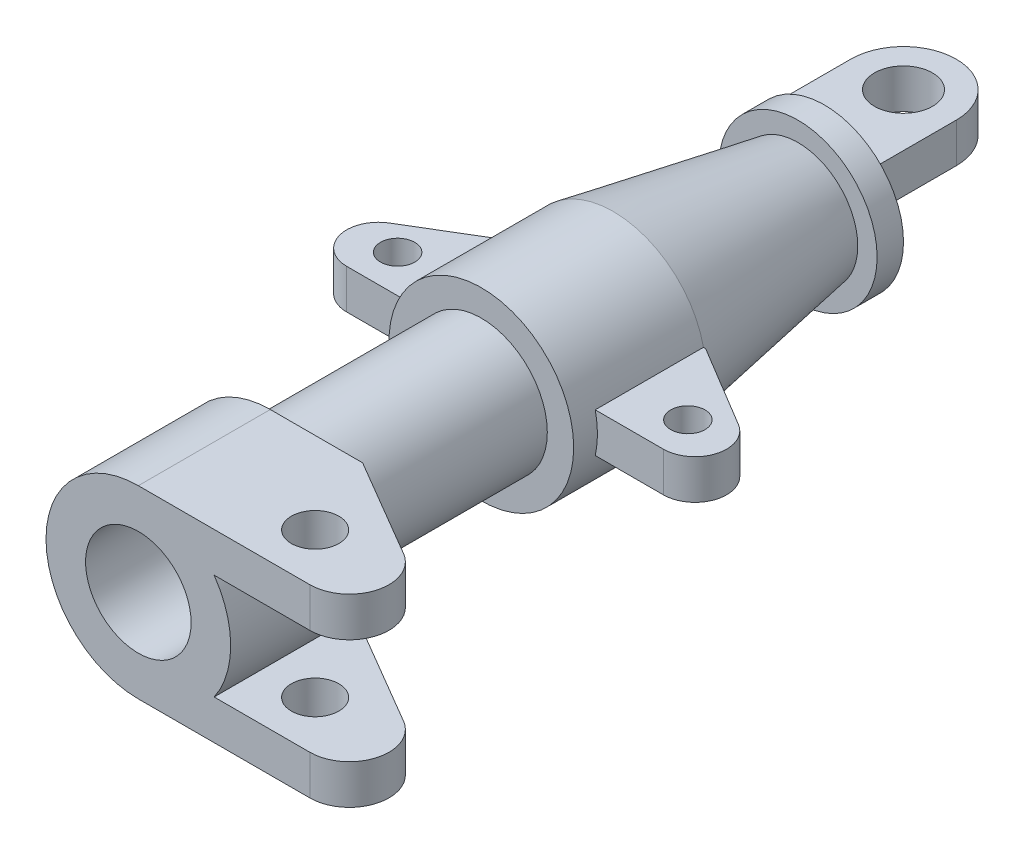
ISO-10303-21;
HEADER;
FILE_DESCRIPTION(('STEP AP214'),'2;1');
FILE_NAME('part.step','',(''),(''),'','','');
FILE_SCHEMA(('AUTOMOTIVE_DESIGN { 1 0 10303 214 1 1 1 1 }'));
ENDSEC;
DATA;
#1=APPLICATION_CONTEXT('core data for automotive mechanical design processes');
#2=APPLICATION_PROTOCOL_DEFINITION('international standard','automotive_design',2000,#1);
#3=PRODUCT_CONTEXT('',#1,'mechanical');
#4=PRODUCT('Part','Part','',(#3));
#5=PRODUCT_RELATED_PRODUCT_CATEGORY('part','',(#4));
#6=PRODUCT_DEFINITION_FORMATION('','',#4);
#7=PRODUCT_DEFINITION_CONTEXT('part definition',#1,'design');
#8=PRODUCT_DEFINITION('design','',#6,#7);
#9=PRODUCT_DEFINITION_SHAPE('','',#8);
#10=(LENGTH_UNIT() NAMED_UNIT(*) SI_UNIT(.MILLI.,.METRE.));
#11=(NAMED_UNIT(*) PLANE_ANGLE_UNIT() SI_UNIT($,.RADIAN.));
#12=(NAMED_UNIT(*) SI_UNIT($,.STERADIAN.) SOLID_ANGLE_UNIT());
#13=UNCERTAINTY_MEASURE_WITH_UNIT(LENGTH_MEASURE(1.E-05),#10,'distance_accuracy_value','');
#14=(GEOMETRIC_REPRESENTATION_CONTEXT(3) GLOBAL_UNCERTAINTY_ASSIGNED_CONTEXT((#13)) GLOBAL_UNIT_ASSIGNED_CONTEXT((#10,
#11,#12)) REPRESENTATION_CONTEXT('',''));
#15=CARTESIAN_POINT('',(0.,0.,0.));
#16=DIRECTION('',(0.,0.,1.));
#17=DIRECTION('',(1.,0.,0.));
#18=AXIS2_PLACEMENT_3D('',#15,#16,#17);
#19=CARTESIAN_POINT('',(0.,0.,-50.));
#20=DIRECTION('',(0.,0.,-1.));
#21=DIRECTION('',(-1.,0.,0.));
#22=AXIS2_PLACEMENT_3D('',#19,#20,#21);
#23=PLANE('',#22);
#24=CARTESIAN_POINT('',(0.,0.,-50.));
#25=DIRECTION('',(0.,0.,1.));
#26=DIRECTION('',(1.,0.,0.));
#27=AXIS2_PLACEMENT_3D('',#24,#25,#26);
#28=CIRCLE('',#27,25.);
#29=CARTESIAN_POINT('',(25.,0.,-50.));
#30=VERTEX_POINT('',#29);
#31=EDGE_CURVE('E398',#30,#30,#28,.T.);
#32=ORIENTED_EDGE('',*,*,#31,.T.);
#33=EDGE_LOOP('',(#32));
#34=FACE_BOUND('',#33,.T.);
#35=DIRECTION('',(0.,-1.,0.));
#36=VECTOR('',#35,1.);
#37=CARTESIAN_POINT('',(35.,35.,-50.));
#38=LINE('',#37,#36);
#39=CARTESIAN_POINT('',(35.,35.,-50.));
#40=VERTEX_POINT('',#39);
#41=CARTESIAN_POINT('',(35.,20.,-50.));
#42=VERTEX_POINT('',#41);
#43=EDGE_CURVE('E305',#40,#42,#38,.T.);
#44=ORIENTED_EDGE('',*,*,#43,.T.);
#45=DIRECTION('',(-1.,0.,0.));
#46=VECTOR('',#45,1.);
#47=CARTESIAN_POINT('',(0.,20.,-50.));
#48=LINE('',#47,#46);
#49=CARTESIAN_POINT('',(28.7228132326902,20.,-50.));
#50=VERTEX_POINT('',#49);
#51=EDGE_CURVE('E237',#42,#50,#48,.T.);
#52=ORIENTED_EDGE('',*,*,#51,.T.);
#53=CARTESIAN_POINT('',(0.,0.,-50.));
#54=DIRECTION('',(0.,0.,-1.));
#55=DIRECTION('',(-1.,0.,0.));
#56=AXIS2_PLACEMENT_3D('',#53,#54,#55);
#57=CIRCLE('',#56,35.);
#58=CARTESIAN_POINT('',(28.7228132326902,-20.,-50.));
#59=VERTEX_POINT('',#58);
#60=EDGE_CURVE('E250',#50,#59,#57,.T.);
#61=ORIENTED_EDGE('',*,*,#60,.T.);
#62=DIRECTION('',(-1.,0.,0.));
#63=VECTOR('',#62,1.);
#64=CARTESIAN_POINT('',(0.,-20.,-50.));
#65=LINE('',#64,#63);
#66=CARTESIAN_POINT('',(35.,-20.,-50.));
#67=VERTEX_POINT('',#66);
#68=EDGE_CURVE('E241',#67,#59,#65,.T.);
#69=ORIENTED_EDGE('',*,*,#68,.F.);
#70=CARTESIAN_POINT('',(35.,-35.,-50.));
#71=VERTEX_POINT('',#70);
#72=EDGE_CURVE('E304',#67,#71,#38,.T.);
#73=ORIENTED_EDGE('',*,*,#72,.T.);
#74=DIRECTION('',(-1.,0.,0.));
#75=VECTOR('',#74,1.);
#76=CARTESIAN_POINT('',(0.,-35.,-50.));
#77=LINE('',#76,#75);
#78=CARTESIAN_POINT('',(0.,-35.,-50.));
#79=VERTEX_POINT('',#78);
#80=EDGE_CURVE('E70',#71,#79,#77,.T.);
#81=ORIENTED_EDGE('',*,*,#80,.T.);
#82=CARTESIAN_POINT('',(0.,0.,-50.));
#83=DIRECTION('',(0.,0.,1.));
#84=DIRECTION('',(1.,0.,0.));
#85=AXIS2_PLACEMENT_3D('',#82,#83,#84);
#86=CIRCLE('',#85,35.);
#87=CARTESIAN_POINT('',(0.,35.,-50.));
#88=VERTEX_POINT('',#87);
#89=EDGE_CURVE('E396',#88,#79,#86,.T.);
#90=ORIENTED_EDGE('',*,*,#89,.F.);
#91=DIRECTION('',(-1.,0.,0.));
#92=VECTOR('',#91,1.);
#93=CARTESIAN_POINT('',(0.,35.,-50.));
#94=LINE('',#93,#92);
#95=EDGE_CURVE('E302',#40,#88,#94,.T.);
#96=ORIENTED_EDGE('',*,*,#95,.F.);
#97=EDGE_LOOP('',(#44,#52,#61,#69,#73,#81,#90,#96));
#98=FACE_BOUND('',#97,.T.);
#99=ADVANCED_FACE('F45',(#34,#98),#23,.T.);
#100=CARTESIAN_POINT('',(0.,0.,0.));
#101=DIRECTION('',(0.,0.,1.));
#102=DIRECTION('',(1.,0.,0.));
#103=AXIS2_PLACEMENT_3D('',#100,#101,#102);
#104=PLANE('',#103);
#105=CARTESIAN_POINT('',(0.,0.,0.));
#106=DIRECTION('',(0.,0.,1.));
#107=DIRECTION('',(1.,0.,0.));
#108=AXIS2_PLACEMENT_3D('',#105,#106,#107);
#109=CIRCLE('',#108,20.);
#110=CARTESIAN_POINT('',(20.,0.,0.));
#111=VERTEX_POINT('',#110);
#112=EDGE_CURVE('E390',#111,#111,#109,.T.);
#113=ORIENTED_EDGE('',*,*,#112,.F.);
#114=EDGE_LOOP('',(#113));
#115=FACE_BOUND('',#114,.T.);
#116=CARTESIAN_POINT('',(0.,0.,0.));
#117=DIRECTION('',(0.,0.,-1.));
#118=DIRECTION('',(-1.,0.,0.));
#119=AXIS2_PLACEMENT_3D('',#116,#117,#118);
#120=CIRCLE('',#119,35.);
#121=CARTESIAN_POINT('',(28.7228132326902,20.,0.));
#122=VERTEX_POINT('',#121);
#123=CARTESIAN_POINT('',(28.7228132326902,-20.,0.));
#124=VERTEX_POINT('',#123);
#125=EDGE_CURVE('E253',#122,#124,#120,.T.);
#126=ORIENTED_EDGE('',*,*,#125,.F.);
#127=DIRECTION('',(-1.,0.,0.));
#128=VECTOR('',#127,1.);
#129=CARTESIAN_POINT('',(0.,20.,0.));
#130=LINE('',#129,#128);
#131=CARTESIAN_POINT('',(65.,20.,0.));
#132=VERTEX_POINT('',#131);
#133=EDGE_CURVE('E247',#132,#122,#130,.T.);
#134=ORIENTED_EDGE('',*,*,#133,.F.);
#135=DIRECTION('',(0.,-1.,0.));
#136=VECTOR('',#135,1.);
#137=CARTESIAN_POINT('',(65.,35.,0.));
#138=LINE('',#137,#136);
#139=CARTESIAN_POINT('',(65.,35.,0.));
#140=VERTEX_POINT('',#139);
#141=EDGE_CURVE('E313',#140,#132,#138,.T.);
#142=ORIENTED_EDGE('',*,*,#141,.F.);
#143=DIRECTION('',(1.,0.,0.));
#144=VECTOR('',#143,1.);
#145=CARTESIAN_POINT('',(0.,35.,0.));
#146=LINE('',#145,#144);
#147=CARTESIAN_POINT('',(0.,35.,0.));
#148=VERTEX_POINT('',#147);
#149=EDGE_CURVE('E294',#148,#140,#146,.T.);
#150=ORIENTED_EDGE('',*,*,#149,.F.);
#151=CARTESIAN_POINT('',(0.,0.,0.));
#152=DIRECTION('',(0.,0.,1.));
#153=DIRECTION('',(1.,0.,0.));
#154=AXIS2_PLACEMENT_3D('',#151,#152,#153);
#155=CIRCLE('',#154,35.);
#156=CARTESIAN_POINT('',(0.,-35.,0.));
#157=VERTEX_POINT('',#156);
#158=EDGE_CURVE('E393',#148,#157,#155,.T.);
#159=ORIENTED_EDGE('',*,*,#158,.T.);
#160=DIRECTION('',(1.,0.,0.));
#161=VECTOR('',#160,1.);
#162=CARTESIAN_POINT('',(0.,-35.,0.));
#163=LINE('',#162,#161);
#164=CARTESIAN_POINT('',(65.,-35.,0.));
#165=VERTEX_POINT('',#164);
#166=EDGE_CURVE('E281',#157,#165,#163,.T.);
#167=ORIENTED_EDGE('',*,*,#166,.T.);
#168=CARTESIAN_POINT('',(65.,-20.,0.));
#169=VERTEX_POINT('',#168);
#170=EDGE_CURVE('E312',#169,#165,#138,.T.);
#171=ORIENTED_EDGE('',*,*,#170,.F.);
#172=DIRECTION('',(-1.,0.,0.));
#173=VECTOR('',#172,1.);
#174=CARTESIAN_POINT('',(0.,-20.,0.));
#175=LINE('',#174,#173);
#176=EDGE_CURVE('E249',#169,#124,#175,.T.);
#177=ORIENTED_EDGE('',*,*,#176,.T.);
#178=EDGE_LOOP('',(#126,#134,#142,#150,#159,#167,#171,#177));
#179=FACE_BOUND('',#178,.T.);
#180=ADVANCED_FACE('F461',(#115,#179),#104,.T.);
#181=CARTESIAN_POINT('',(65.,35.,-15.));
#182=DIRECTION('',(0.,-1.,0.));
#183=DIRECTION('',(0.,0.,-1.));
#184=AXIS2_PLACEMENT_3D('',#181,#182,#183);
#185=CYLINDRICAL_SURFACE('',#184,15.);
#186=CARTESIAN_POINT('',(65.,20.,-15.));
#187=DIRECTION('',(0.,-1.,0.));
#188=DIRECTION('',(0.,0.,-1.));
#189=AXIS2_PLACEMENT_3D('',#186,#187,#188);
#190=CIRCLE('',#189,15.);
#191=CARTESIAN_POINT('',(72.5925738605123,20.,-27.9364918804391));
#192=VERTEX_POINT('',#191);
#193=EDGE_CURVE('E270',#192,#132,#190,.T.);
#194=ORIENTED_EDGE('',*,*,#193,.F.);
#195=DIRECTION('',(0.,-1.,0.));
#196=VECTOR('',#195,1.);
#197=CARTESIAN_POINT('',(72.5925738605123,35.,-27.9364918804391));
#198=LINE('',#197,#196);
#199=CARTESIAN_POINT('',(72.5925738605123,35.,-27.9364918804391));
#200=VERTEX_POINT('',#199);
#201=EDGE_CURVE('E309',#200,#192,#198,.T.);
#202=ORIENTED_EDGE('',*,*,#201,.F.);
#203=CARTESIAN_POINT('',(65.,35.,-15.));
#204=DIRECTION('',(0.,1.,0.));
#205=DIRECTION('',(0.,0.,1.));
#206=AXIS2_PLACEMENT_3D('',#203,#204,#205);
#207=CIRCLE('',#206,15.);
#208=EDGE_CURVE('E297',#140,#200,#207,.T.);
#209=ORIENTED_EDGE('',*,*,#208,.F.);
#210=ORIENTED_EDGE('',*,*,#141,.T.);
#211=EDGE_LOOP('',(#194,#202,#209,#210));
#212=FACE_BOUND('',#211,.T.);
#213=ADVANCED_FACE('F473',(#212),#185,.T.);
#214=CARTESIAN_POINT('',(30.794287683841,35.,-52.4683802758603));
#215=DIRECTION('',(-0.506171590700817,0.,0.862432792029272));
#216=DIRECTION('',(0.862432792029272,0.,0.506171590700817));
#217=AXIS2_PLACEMENT_3D('',#214,#215,#216);
#218=PLANE('',#217);
#219=DIRECTION('',(0.862432792029272,0.,0.506171590700817));
#220=VECTOR('',#219,1.);
#221=CARTESIAN_POINT('',(30.794287683841,20.,-52.4683802758603));
#222=LINE('',#221,#220);
#223=EDGE_CURVE('E268',#42,#192,#222,.T.);
#224=ORIENTED_EDGE('',*,*,#223,.F.);
#225=ORIENTED_EDGE('',*,*,#43,.F.);
#226=DIRECTION('',(-0.862432792029272,0.,-0.506171590700817));
#227=VECTOR('',#226,1.);
#228=CARTESIAN_POINT('',(30.794287683841,35.,-52.4683802758603));
#229=LINE('',#228,#227);
#230=EDGE_CURVE('E299',#200,#40,#229,.T.);
#231=ORIENTED_EDGE('',*,*,#230,.F.);
#232=ORIENTED_EDGE('',*,*,#201,.T.);
#233=EDGE_LOOP('',(#224,#225,#231,#232));
#234=FACE_BOUND('',#233,.T.);
#235=ADVANCED_FACE('F469',(#234),#218,.F.);
#236=CARTESIAN_POINT('',(48.,35.,-19.));
#237=DIRECTION('',(0.,-1.,0.));
#238=DIRECTION('',(0.,0.,-1.));
#239=AXIS2_PLACEMENT_3D('',#236,#237,#238);
#240=CYLINDRICAL_SURFACE('',#239,9.);
#241=CARTESIAN_POINT('',(48.,35.,-19.));
#242=DIRECTION('',(0.,1.,0.));
#243=DIRECTION('',(0.,0.,1.));
#244=AXIS2_PLACEMENT_3D('',#241,#242,#243);
#245=CIRCLE('',#244,9.);
#246=CARTESIAN_POINT('',(48.,35.,-10.));
#247=VERTEX_POINT('',#246);
#248=EDGE_CURVE('E291',#247,#247,#245,.T.);
#249=ORIENTED_EDGE('',*,*,#248,.T.);
#250=EDGE_LOOP('',(#249));
#251=FACE_BOUND('',#250,.T.);
#252=CARTESIAN_POINT('',(48.,20.,-19.));
#253=DIRECTION('',(0.,-1.,0.));
#254=DIRECTION('',(0.,0.,-1.));
#255=AXIS2_PLACEMENT_3D('',#252,#253,#254);
#256=CIRCLE('',#255,9.);
#257=CARTESIAN_POINT('',(48.,20.,-28.));
#258=VERTEX_POINT('',#257);
#259=EDGE_CURVE('E49',#258,#258,#256,.T.);
#260=ORIENTED_EDGE('',*,*,#259,.T.);
#261=EDGE_LOOP('',(#260));
#262=FACE_BOUND('',#261,.T.);
#263=ADVANCED_FACE('F443',(#251,#262),#240,.F.);
#264=CARTESIAN_POINT('',(0.,0.,0.));
#265=DIRECTION('',(0.,0.,1.));
#266=DIRECTION('',(1.,0.,0.));
#267=AXIS2_PLACEMENT_3D('',#264,#265,#266);
#268=CYLINDRICAL_SURFACE('',#267,35.);
#269=DIRECTION('',(0.,0.,1.));
#270=VECTOR('',#269,1.);
#271=CARTESIAN_POINT('',(0.,-35.,-50.));
#272=LINE('',#271,#270);
#273=EDGE_CURVE('E272',#79,#157,#272,.T.);
#274=ORIENTED_EDGE('',*,*,#273,.T.);
#275=ORIENTED_EDGE('',*,*,#158,.F.);
#276=DIRECTION('',(0.,0.,1.));
#277=VECTOR('',#276,1.);
#278=CARTESIAN_POINT('',(0.,35.,-50.));
#279=LINE('',#278,#277);
#280=EDGE_CURVE('E275',#88,#148,#279,.T.);
#281=ORIENTED_EDGE('',*,*,#280,.F.);
#282=ORIENTED_EDGE('',*,*,#89,.T.);
#283=EDGE_LOOP('',(#274,#275,#281,#282));
#284=FACE_BOUND('',#283,.T.);
#285=ADVANCED_FACE('F458',(#284),#268,.T.);
#286=CARTESIAN_POINT('',(0.,0.,-235.));
#287=DIRECTION('',(0.,0.,-1.));
#288=DIRECTION('',(-1.,0.,0.));
#289=AXIS2_PLACEMENT_3D('',#286,#287,#288);
#290=PLANE('',#289);
#291=CARTESIAN_POINT('',(0.,0.,-235.));
#292=DIRECTION('',(0.,0.,1.));
#293=DIRECTION('',(1.,0.,0.));
#294=AXIS2_PLACEMENT_3D('',#291,#292,#293);
#295=CIRCLE('',#294,20.);
#296=CARTESIAN_POINT('',(20.,0.,-235.));
#297=VERTEX_POINT('',#296);
#298=EDGE_CURVE('E387',#297,#297,#295,.T.);
#299=ORIENTED_EDGE('',*,*,#298,.T.);
#300=EDGE_LOOP('',(#299));
#301=FACE_BOUND('',#300,.T.);
#302=ADVANCED_FACE('F47',(#301),#290,.F.);
#303=CARTESIAN_POINT('',(0.,0.,-260.));
#304=DIRECTION('',(0.,0.,-1.));
#305=DIRECTION('',(-1.,0.,0.));
#306=AXIS2_PLACEMENT_3D('',#303,#304,#305);
#307=PLANE('',#306);
#308=DIRECTION('',(0.,-1.,0.));
#309=VECTOR('',#308,1.);
#310=CARTESIAN_POINT('',(-20.,20.,-260.));
#311=LINE('',#310,#309);
#312=CARTESIAN_POINT('',(-20.,20.,-260.));
#313=VERTEX_POINT('',#312);
#314=CARTESIAN_POINT('',(-20.,5.,-260.));
#315=VERTEX_POINT('',#314);
#316=EDGE_CURVE('E243',#313,#315,#311,.T.);
#317=ORIENTED_EDGE('',*,*,#316,.T.);
#318=DIRECTION('',(-1.,0.,0.));
#319=VECTOR('',#318,1.);
#320=CARTESIAN_POINT('',(0.,5.,-260.));
#321=LINE('',#320,#319);
#322=CARTESIAN_POINT('',(20.,5.,-260.));
#323=VERTEX_POINT('',#322);
#324=EDGE_CURVE('E976',#323,#315,#321,.T.);
#325=ORIENTED_EDGE('',*,*,#324,.F.);
#326=DIRECTION('',(0.,-1.,0.));
#327=VECTOR('',#326,1.);
#328=CARTESIAN_POINT('',(20.,20.,-260.));
#329=LINE('',#328,#327);
#330=CARTESIAN_POINT('',(20.,20.,-260.));
#331=VERTEX_POINT('',#330);
#332=EDGE_CURVE('E231',#331,#323,#329,.T.);
#333=ORIENTED_EDGE('',*,*,#332,.F.);
#334=DIRECTION('',(-1.,0.,0.));
#335=VECTOR('',#334,1.);
#336=CARTESIAN_POINT('',(0.,20.,-260.));
#337=LINE('',#336,#335);
#338=EDGE_CURVE('E987',#331,#313,#337,.T.);
#339=ORIENTED_EDGE('',*,*,#338,.T.);
#340=EDGE_LOOP('',(#317,#325,#333,#339));
#341=FACE_BOUND('',#340,.T.);
#342=CARTESIAN_POINT('',(0.,0.,-260.));
#343=DIRECTION('',(0.,0.,1.));
#344=DIRECTION('',(1.,0.,0.));
#345=AXIS2_PLACEMENT_3D('',#342,#343,#344);
#346=CIRCLE('',#345,30.);
#347=CARTESIAN_POINT('',(30.,0.,-260.));
#348=VERTEX_POINT('',#347);
#349=EDGE_CURVE('E417',#348,#348,#346,.T.);
#350=ORIENTED_EDGE('',*,*,#349,.F.);
#351=EDGE_LOOP('',(#350));
#352=FACE_BOUND('',#351,.T.);
#353=ADVANCED_FACE('F532',(#341,#352),#307,.T.);
#354=CARTESIAN_POINT('',(0.,0.,0.));
#355=DIRECTION('',(0.,0.,1.));
#356=DIRECTION('',(1.,0.,0.));
#357=AXIS2_PLACEMENT_3D('',#354,#355,#356);
#358=CYLINDRICAL_SURFACE('',#357,30.);
#359=ORIENTED_EDGE('',*,*,#349,.T.);
#360=EDGE_LOOP('',(#359));
#361=FACE_BOUND('',#360,.T.);
#362=CARTESIAN_POINT('',(0.,0.,-250.));
#363=DIRECTION('',(0.,0.,1.));
#364=DIRECTION('',(1.,0.,0.));
#365=AXIS2_PLACEMENT_3D('',#362,#363,#364);
#366=CIRCLE('',#365,30.);
#367=CARTESIAN_POINT('',(30.,0.,-250.));
#368=VERTEX_POINT('',#367);
#369=EDGE_CURVE('E414',#368,#368,#366,.T.);
#370=ORIENTED_EDGE('',*,*,#369,.F.);
#371=EDGE_LOOP('',(#370));
#372=FACE_BOUND('',#371,.T.);
#373=ADVANCED_FACE('F529',(#361,#372),#358,.T.);
#374=CARTESIAN_POINT('',(0.,0.,-250.));
#375=DIRECTION('',(0.,0.,1.));
#376=DIRECTION('',(1.,0.,0.));
#377=AXIS2_PLACEMENT_3D('',#374,#375,#376);
#378=PLANE('',#377);
#379=ORIENTED_EDGE('',*,*,#369,.T.);
#380=EDGE_LOOP('',(#379));
#381=FACE_BOUND('',#380,.T.);
#382=CARTESIAN_POINT('',(0.,0.,-250.));
#383=DIRECTION('',(0.,0.,1.));
#384=DIRECTION('',(1.,0.,0.));
#385=AXIS2_PLACEMENT_3D('',#382,#383,#384);
#386=CIRCLE('',#385,22.6571113504074);
#387=CARTESIAN_POINT('',(22.6571113504074,0.,-250.));
#388=VERTEX_POINT('',#387);
#389=EDGE_CURVE('E410',#388,#388,#386,.T.);
#390=ORIENTED_EDGE('',*,*,#389,.F.);
#391=EDGE_LOOP('',(#390));
#392=FACE_BOUND('',#391,.T.);
#393=ADVANCED_FACE('F525',(#381,#392),#378,.T.);
#394=CARTESIAN_POINT('',(0.,0.,-180.));
#395=DIRECTION('',(0.,0.,1.));
#396=DIRECTION('',(1.,0.,0.));
#397=AXIS2_PLACEMENT_3D('',#394,#395,#396);
#398=CONICAL_SURFACE('',#397,35.,0.174532925199433);
#399=ORIENTED_EDGE('',*,*,#389,.T.);
#400=EDGE_LOOP('',(#399));
#401=FACE_BOUND('',#400,.T.);
#402=CARTESIAN_POINT('',(0.,0.,-180.));
#403=DIRECTION('',(0.,0.,1.));
#404=DIRECTION('',(1.,0.,0.));
#405=AXIS2_PLACEMENT_3D('',#402,#403,#404);
#406=CIRCLE('',#405,35.);
#407=CARTESIAN_POINT('',(-34.1869858279434,7.5,-180.));
#408=VERTEX_POINT('',#407);
#409=CARTESIAN_POINT('',(-35.,0.,-180.));
#410=VERTEX_POINT('',#409);
#411=EDGE_CURVE('E408',#408,#410,#406,.T.);
#412=ORIENTED_EDGE('',*,*,#411,.F.);
#413=CARTESIAN_POINT('',(34.1869858279434,7.5,-180.));
#414=VERTEX_POINT('',#413);
#415=EDGE_CURVE('E407',#414,#408,#406,.T.);
#416=ORIENTED_EDGE('',*,*,#415,.F.);
#417=CARTESIAN_POINT('',(35.,0.,-180.));
#418=VERTEX_POINT('',#417);
#419=EDGE_CURVE('E574',#418,#414,#406,.T.);
#420=ORIENTED_EDGE('',*,*,#419,.F.);
#421=CARTESIAN_POINT('',(34.1869858279434,-7.5,-180.));
#422=VERTEX_POINT('',#421);
#423=EDGE_CURVE('E575',#422,#418,#406,.T.);
#424=ORIENTED_EDGE('',*,*,#423,.F.);
#425=CARTESIAN_POINT('',(-34.1869858279434,-7.5,-180.));
#426=VERTEX_POINT('',#425);
#427=EDGE_CURVE('E578',#426,#422,#406,.T.);
#428=ORIENTED_EDGE('',*,*,#427,.F.);
#429=EDGE_CURVE('E411',#410,#426,#406,.T.);
#430=ORIENTED_EDGE('',*,*,#429,.F.);
#431=EDGE_LOOP('',(#412,#416,#420,#424,#428,#430));
#432=FACE_BOUND('',#431,.T.);
#433=ADVANCED_FACE('F521',(#401,#432),#398,.T.);
#434=CARTESIAN_POINT('',(0.,0.,0.));
#435=DIRECTION('',(0.,0.,1.));
#436=DIRECTION('',(1.,0.,0.));
#437=AXIS2_PLACEMENT_3D('',#434,#435,#436);
#438=CYLINDRICAL_SURFACE('',#437,35.);
#439=DIRECTION('',(0.,0.,1.));
#440=VECTOR('',#439,1.);
#441=CARTESIAN_POINT('',(34.1869858279434,7.5,0.));
#442=LINE('',#441,#440);
#443=CARTESIAN_POINT('',(34.1869858279434,7.5,-138.978883757727));
#444=VERTEX_POINT('',#443);
#445=EDGE_CURVE('E11',#414,#444,#442,.T.);
#446=ORIENTED_EDGE('',*,*,#445,.F.);
#447=ORIENTED_EDGE('',*,*,#415,.T.);
#448=DIRECTION('',(0.,0.,1.));
#449=VECTOR('',#448,1.);
#450=CARTESIAN_POINT('',(-34.1869858279434,7.5,0.));
#451=LINE('',#450,#449);
#452=CARTESIAN_POINT('',(-34.1869858279434,7.5,-138.978883757727));
#453=VERTEX_POINT('',#452);
#454=EDGE_CURVE('E425',#453,#408,#451,.F.);
#455=ORIENTED_EDGE('',*,*,#454,.F.);
#456=CARTESIAN_POINT('',(0.,0.,-138.978883757727));
#457=DIRECTION('',(0.,0.,1.));
#458=DIRECTION('',(1.,0.,0.));
#459=AXIS2_PLACEMENT_3D('',#456,#457,#458);
#460=CIRCLE('',#459,35.);
#461=CARTESIAN_POINT('',(-34.1869858279434,-7.5,-138.978883757727));
#462=VERTEX_POINT('',#461);
#463=EDGE_CURVE('E423',#462,#453,#460,.F.);
#464=ORIENTED_EDGE('',*,*,#463,.F.);
#465=DIRECTION('',(0.,0.,1.));
#466=VECTOR('',#465,1.);
#467=CARTESIAN_POINT('',(-34.1869858279434,-7.5,0.));
#468=LINE('',#467,#466);
#469=EDGE_CURVE('E420',#462,#426,#468,.F.);
#470=ORIENTED_EDGE('',*,*,#469,.T.);
#471=ORIENTED_EDGE('',*,*,#427,.T.);
#472=DIRECTION('',(0.,0.,1.));
#473=VECTOR('',#472,1.);
#474=CARTESIAN_POINT('',(34.1869858279434,-7.5,0.));
#475=LINE('',#474,#473);
#476=CARTESIAN_POINT('',(34.1869858279434,-7.5,-138.978883757727));
#477=VERTEX_POINT('',#476);
#478=EDGE_CURVE('E428',#422,#477,#475,.T.);
#479=ORIENTED_EDGE('',*,*,#478,.T.);
#480=CARTESIAN_POINT('',(0.,0.,-138.978883757727));
#481=DIRECTION('',(0.,0.,-1.));
#482=DIRECTION('',(-1.,0.,0.));
#483=AXIS2_PLACEMENT_3D('',#480,#481,#482);
#484=CIRCLE('',#483,35.);
#485=EDGE_CURVE('E54',#477,#444,#484,.F.);
#486=ORIENTED_EDGE('',*,*,#485,.T.);
#487=EDGE_LOOP('',(#446,#447,#455,#464,#470,#471,#479,#486));
#488=FACE_BOUND('',#487,.T.);
#489=CARTESIAN_POINT('',(0.,0.,-130.));
#490=DIRECTION('',(0.,0.,1.));
#491=DIRECTION('',(1.,0.,0.));
#492=AXIS2_PLACEMENT_3D('',#489,#490,#491);
#493=CIRCLE('',#492,35.);
#494=CARTESIAN_POINT('',(35.,0.,-130.));
#495=VERTEX_POINT('',#494);
#496=EDGE_CURVE('E404',#495,#495,#493,.T.);
#497=ORIENTED_EDGE('',*,*,#496,.F.);
#498=EDGE_LOOP('',(#497));
#499=FACE_BOUND('',#498,.T.);
#500=ADVANCED_FACE('F517',(#488,#499),#438,.T.);
#501=CARTESIAN_POINT('',(0.,0.,-130.));
#502=DIRECTION('',(0.,0.,1.));
#503=DIRECTION('',(1.,0.,0.));
#504=AXIS2_PLACEMENT_3D('',#501,#502,#503);
#505=PLANE('',#504);
#506=ORIENTED_EDGE('',*,*,#496,.T.);
#507=EDGE_LOOP('',(#506));
#508=FACE_BOUND('',#507,.T.);
#509=CARTESIAN_POINT('',(0.,0.,-130.));
#510=DIRECTION('',(0.,0.,1.));
#511=DIRECTION('',(1.,0.,0.));
#512=AXIS2_PLACEMENT_3D('',#509,#510,#511);
#513=CIRCLE('',#512,25.);
#514=CARTESIAN_POINT('',(25.,0.,-130.));
#515=VERTEX_POINT('',#514);
#516=EDGE_CURVE('E401',#515,#515,#513,.T.);
#517=ORIENTED_EDGE('',*,*,#516,.F.);
#518=EDGE_LOOP('',(#517));
#519=FACE_BOUND('',#518,.T.);
#520=ADVANCED_FACE('F513',(#508,#519),#505,.T.);
#521=CARTESIAN_POINT('',(0.,0.,0.));
#522=DIRECTION('',(0.,0.,1.));
#523=DIRECTION('',(1.,0.,0.));
#524=AXIS2_PLACEMENT_3D('',#521,#522,#523);
#525=CYLINDRICAL_SURFACE('',#524,25.);
#526=ORIENTED_EDGE('',*,*,#516,.T.);
#527=EDGE_LOOP('',(#526));
#528=FACE_BOUND('',#527,.T.);
#529=ORIENTED_EDGE('',*,*,#31,.F.);
#530=EDGE_LOOP('',(#529));
#531=FACE_BOUND('',#530,.T.);
#532=ADVANCED_FACE('F509',(#528,#531),#525,.T.);
#533=CARTESIAN_POINT('',(0.,0.,0.));
#534=DIRECTION('',(0.,0.,1.));
#535=DIRECTION('',(1.,0.,0.));
#536=AXIS2_PLACEMENT_3D('',#533,#534,#535);
#537=CYLINDRICAL_SURFACE('',#536,20.);
#538=ORIENTED_EDGE('',*,*,#298,.F.);
#539=EDGE_LOOP('',(#538));
#540=FACE_BOUND('',#539,.T.);
#541=ORIENTED_EDGE('',*,*,#112,.T.);
#542=EDGE_LOOP('',(#541));
#543=FACE_BOUND('',#542,.T.);
#544=ADVANCED_FACE('F512',(#540,#543),#537,.F.);
#545=CARTESIAN_POINT('',(0.,7.5,-180.));
#546=DIRECTION('',(0.,0.,-1.));
#547=DIRECTION('',(-1.,0.,0.));
#548=AXIS2_PLACEMENT_3D('',#545,#546,#547);
#549=PLANE('',#548);
#550=DIRECTION('',(0.,-1.,0.));
#551=VECTOR('',#550,1.);
#552=CARTESIAN_POINT('',(-35.,7.5,-180.));
#553=LINE('',#552,#551);
#554=CARTESIAN_POINT('',(-35.,-7.5,-180.));
#555=VERTEX_POINT('',#554);
#556=EDGE_CURVE('E380',#410,#555,#553,.T.);
#557=ORIENTED_EDGE('',*,*,#556,.F.);
#558=ORIENTED_EDGE('',*,*,#429,.T.);
#559=DIRECTION('',(1.,0.,0.));
#560=VECTOR('',#559,1.);
#561=CARTESIAN_POINT('',(0.,-7.5,-180.));
#562=LINE('',#561,#560);
#563=EDGE_CURVE('E375',#555,#426,#562,.T.);
#564=ORIENTED_EDGE('',*,*,#563,.F.);
#565=EDGE_LOOP('',(#557,#558,#564));
#566=FACE_BOUND('',#565,.T.);
#567=ADVANCED_FACE('F561',(#566),#549,.T.);
#568=CARTESIAN_POINT('',(-60.,7.5,-150.978883757727));
#569=DIRECTION('',(0.,-1.,0.));
#570=DIRECTION('',(0.,0.,-1.));
#571=AXIS2_PLACEMENT_3D('',#568,#569,#570);
#572=CYLINDRICAL_SURFACE('',#571,12.);
#573=CARTESIAN_POINT('',(-60.,-7.5,-150.978883757727));
#574=DIRECTION('',(0.,1.,0.));
#575=DIRECTION('',(0.,0.,1.));
#576=AXIS2_PLACEMENT_3D('',#573,#574,#575);
#577=CIRCLE('',#576,12.);
#578=CARTESIAN_POINT('',(-60.,-7.5,-138.978883757727));
#579=VERTEX_POINT('',#578);
#580=CARTESIAN_POINT('',(-66.1804568989206,-7.5,-161.264891366153));
#581=VERTEX_POINT('',#580);
#582=EDGE_CURVE('E370',#579,#581,#577,.F.);
#583=ORIENTED_EDGE('',*,*,#582,.F.);
#584=DIRECTION('',(0.,-1.,0.));
#585=VECTOR('',#584,1.);
#586=CARTESIAN_POINT('',(-60.,7.5,-138.978883757727));
#587=LINE('',#586,#585);
#588=CARTESIAN_POINT('',(-60.,7.5,-138.978883757727));
#589=VERTEX_POINT('',#588);
#590=EDGE_CURVE('E384',#589,#579,#587,.T.);
#591=ORIENTED_EDGE('',*,*,#590,.F.);
#592=CARTESIAN_POINT('',(-60.,7.5,-150.978883757727));
#593=DIRECTION('',(0.,1.,0.));
#594=DIRECTION('',(0.,0.,1.));
#595=AXIS2_PLACEMENT_3D('',#592,#593,#594);
#596=CIRCLE('',#595,12.);
#597=CARTESIAN_POINT('',(-66.1804568989206,7.5,-161.264891366153));
#598=VERTEX_POINT('',#597);
#599=EDGE_CURVE('E355',#589,#598,#596,.F.);
#600=ORIENTED_EDGE('',*,*,#599,.T.);
#601=DIRECTION('',(0.,-1.,0.));
#602=VECTOR('',#601,1.);
#603=CARTESIAN_POINT('',(-66.1804568989206,7.5,-161.264891366153));
#604=LINE('',#603,#602);
#605=EDGE_CURVE('E367',#598,#581,#604,.T.);
#606=ORIENTED_EDGE('',*,*,#605,.T.);
#607=EDGE_LOOP('',(#583,#591,#600,#606));
#608=FACE_BOUND('',#607,.T.);
#609=ADVANCED_FACE('F592',(#608),#572,.T.);
#610=CARTESIAN_POINT('',(1.54297556684532E-13,7.5,-138.978883757727));
#611=DIRECTION('',(0.,0.,1.));
#612=DIRECTION('',(1.,0.,0.));
#613=AXIS2_PLACEMENT_3D('',#610,#611,#612);
#614=PLANE('',#613);
#615=DIRECTION('',(-1.,0.,0.));
#616=VECTOR('',#615,1.);
#617=CARTESIAN_POINT('',(1.54297556684532E-13,-7.5,-138.978883757727));
#618=LINE('',#617,#616);
#619=EDGE_CURVE('E373',#462,#579,#618,.T.);
#620=ORIENTED_EDGE('',*,*,#619,.F.);
#621=ORIENTED_EDGE('',*,*,#463,.T.);
#622=DIRECTION('',(-1.,0.,0.));
#623=VECTOR('',#622,1.);
#624=CARTESIAN_POINT('',(1.54297556684532E-13,7.5,-138.978883757727));
#625=LINE('',#624,#623);
#626=EDGE_CURVE('E359',#453,#589,#625,.T.);
#627=ORIENTED_EDGE('',*,*,#626,.T.);
#628=ORIENTED_EDGE('',*,*,#590,.T.);
#629=EDGE_LOOP('',(#620,#621,#627,#628));
#630=FACE_BOUND('',#629,.T.);
#631=ADVANCED_FACE('F588',(#630),#614,.T.);
#632=DIRECTION('',(1.,0.,0.));
#633=VECTOR('',#632,1.);
#634=CARTESIAN_POINT('',(0.,7.5,-180.));
#635=LINE('',#634,#633);
#636=CARTESIAN_POINT('',(-35.,7.5,-180.));
#637=VERTEX_POINT('',#636);
#638=EDGE_CURVE('E361',#637,#408,#635,.T.);
#639=ORIENTED_EDGE('',*,*,#638,.T.);
#640=ORIENTED_EDGE('',*,*,#411,.T.);
#641=EDGE_CURVE('E381',#637,#410,#553,.T.);
#642=ORIENTED_EDGE('',*,*,#641,.F.);
#643=EDGE_LOOP('',(#639,#640,#642));
#644=FACE_BOUND('',#643,.T.);
#645=ADVANCED_FACE('F557',(#644),#549,.T.);
#646=CARTESIAN_POINT('',(-55.,7.5,-153.268883757727));
#647=DIRECTION('',(0.,-1.,0.));
#648=DIRECTION('',(0.,0.,-1.));
#649=AXIS2_PLACEMENT_3D('',#646,#647,#648);
#650=CYLINDRICAL_SURFACE('',#649,6.5);
#651=CARTESIAN_POINT('',(-55.,7.5,-153.268883757727));
#652=DIRECTION('',(0.,1.,0.));
#653=DIRECTION('',(0.,0.,1.));
#654=AXIS2_PLACEMENT_3D('',#651,#652,#653);
#655=CIRCLE('',#654,6.5);
#656=CARTESIAN_POINT('',(-55.,7.5,-146.768883757727));
#657=VERTEX_POINT('',#656);
#658=EDGE_CURVE('E352',#657,#657,#655,.T.);
#659=ORIENTED_EDGE('',*,*,#658,.T.);
#660=EDGE_LOOP('',(#659));
#661=FACE_BOUND('',#660,.T.);
#662=CARTESIAN_POINT('',(-55.,-7.5,-153.268883757727));
#663=DIRECTION('',(0.,1.,0.));
#664=DIRECTION('',(0.,0.,1.));
#665=AXIS2_PLACEMENT_3D('',#662,#663,#664);
#666=CIRCLE('',#665,6.5);
#667=CARTESIAN_POINT('',(-55.,-7.5,-146.768883757727));
#668=VERTEX_POINT('',#667);
#669=EDGE_CURVE('E351',#668,#668,#666,.T.);
#670=ORIENTED_EDGE('',*,*,#669,.F.);
#671=EDGE_LOOP('',(#670));
#672=FACE_BOUND('',#671,.T.);
#673=ADVANCED_FACE('F602',(#661,#672),#650,.F.);
#674=CARTESIAN_POINT('',(-88.7495310085496,7.5,-147.704023525762));
#675=DIRECTION('',(-0.515038074910049,0.,-0.857167300702116));
#676=DIRECTION('',(-0.857167300702116,0.,0.515038074910049));
#677=AXIS2_PLACEMENT_3D('',#674,#675,#676);
#678=PLANE('',#677);
#679=DIRECTION('',(0.857167300702116,0.,-0.515038074910049));
#680=VECTOR('',#679,1.);
#681=CARTESIAN_POINT('',(-88.7495310085496,-7.5,-147.704023525762));
#682=LINE('',#681,#680);
#683=EDGE_CURVE('E356',#581,#555,#682,.T.);
#684=ORIENTED_EDGE('',*,*,#683,.F.);
#685=ORIENTED_EDGE('',*,*,#605,.F.);
#686=DIRECTION('',(0.857167300702116,0.,-0.515038074910049));
#687=VECTOR('',#686,1.);
#688=CARTESIAN_POINT('',(-88.7495310085496,7.5,-147.704023525762));
#689=LINE('',#688,#687);
#690=EDGE_CURVE('E364',#598,#637,#689,.T.);
#691=ORIENTED_EDGE('',*,*,#690,.T.);
#692=ORIENTED_EDGE('',*,*,#641,.T.);
#693=ORIENTED_EDGE('',*,*,#556,.T.);
#694=EDGE_LOOP('',(#684,#685,#691,#692,#693));
#695=FACE_BOUND('',#694,.T.);
#696=ADVANCED_FACE('F564',(#695),#678,.T.);
#697=CARTESIAN_POINT('',(0.,7.5,0.));
#698=DIRECTION('',(0.,1.,0.));
#699=DIRECTION('',(0.,0.,1.));
#700=AXIS2_PLACEMENT_3D('',#697,#698,#699);
#701=PLANE('',#700);
#702=ORIENTED_EDGE('',*,*,#658,.F.);
#703=EDGE_LOOP('',(#702));
#704=FACE_BOUND('',#703,.T.);
#705=ORIENTED_EDGE('',*,*,#626,.F.);
#706=ORIENTED_EDGE('',*,*,#454,.T.);
#707=ORIENTED_EDGE('',*,*,#638,.F.);
#708=ORIENTED_EDGE('',*,*,#690,.F.);
#709=ORIENTED_EDGE('',*,*,#599,.F.);
#710=EDGE_LOOP('',(#705,#706,#707,#708,#709));
#711=FACE_BOUND('',#710,.T.);
#712=ADVANCED_FACE('F569',(#704,#711),#701,.T.);
#713=CARTESIAN_POINT('',(0.,-7.5,0.));
#714=DIRECTION('',(0.,1.,0.));
#715=DIRECTION('',(0.,0.,1.));
#716=AXIS2_PLACEMENT_3D('',#713,#714,#715);
#717=PLANE('',#716);
#718=ORIENTED_EDGE('',*,*,#469,.F.);
#719=ORIENTED_EDGE('',*,*,#619,.T.);
#720=ORIENTED_EDGE('',*,*,#582,.T.);
#721=ORIENTED_EDGE('',*,*,#683,.T.);
#722=ORIENTED_EDGE('',*,*,#563,.T.);
#723=EDGE_LOOP('',(#718,#719,#720,#721,#722));
#724=FACE_BOUND('',#723,.T.);
#725=ORIENTED_EDGE('',*,*,#669,.T.);
#726=EDGE_LOOP('',(#725));
#727=FACE_BOUND('',#726,.T.);
#728=ADVANCED_FACE('F585',(#724,#727),#717,.F.);
#729=CARTESIAN_POINT('',(0.,7.5,-180.));
#730=DIRECTION('',(0.,0.,1.));
#731=DIRECTION('',(1.,0.,0.));
#732=AXIS2_PLACEMENT_3D('',#729,#730,#731);
#733=PLANE('',#732);
#734=ORIENTED_EDGE('',*,*,#423,.T.);
#735=DIRECTION('',(0.,-1.,0.));
#736=VECTOR('',#735,1.);
#737=CARTESIAN_POINT('',(35.,7.5,-180.));
#738=LINE('',#737,#736);
#739=CARTESIAN_POINT('',(35.,-7.5,-180.));
#740=VERTEX_POINT('',#739);
#741=EDGE_CURVE('E330',#418,#740,#738,.T.);
#742=ORIENTED_EDGE('',*,*,#741,.T.);
#743=DIRECTION('',(-1.,0.,0.));
#744=VECTOR('',#743,1.);
#745=CARTESIAN_POINT('',(0.,-7.5,-180.));
#746=LINE('',#745,#744);
#747=EDGE_CURVE('E337',#740,#422,#746,.T.);
#748=ORIENTED_EDGE('',*,*,#747,.T.);
#749=EDGE_LOOP('',(#734,#742,#748));
#750=FACE_BOUND('',#749,.T.);
#751=ADVANCED_FACE('F680',(#750),#733,.F.);
#752=CARTESIAN_POINT('',(-3.8574389171133E-13,7.5,-138.978883757727));
#753=DIRECTION('',(0.,0.,-1.));
#754=DIRECTION('',(-1.,0.,0.));
#755=AXIS2_PLACEMENT_3D('',#752,#753,#754);
#756=PLANE('',#755);
#757=ORIENTED_EDGE('',*,*,#485,.F.);
#758=DIRECTION('',(1.,0.,0.));
#759=VECTOR('',#758,1.);
#760=CARTESIAN_POINT('',(-3.8574389171133E-13,-7.5,-138.978883757727));
#761=LINE('',#760,#759);
#762=CARTESIAN_POINT('',(60.,-7.5,-138.978883757727));
#763=VERTEX_POINT('',#762);
#764=EDGE_CURVE('E316',#477,#763,#761,.T.);
#765=ORIENTED_EDGE('',*,*,#764,.T.);
#766=DIRECTION('',(0.,-1.,0.));
#767=VECTOR('',#766,1.);
#768=CARTESIAN_POINT('',(60.,7.5,-138.978883757727));
#769=LINE('',#768,#767);
#770=CARTESIAN_POINT('',(60.,7.5,-138.978883757727));
#771=VERTEX_POINT('',#770);
#772=EDGE_CURVE('E348',#771,#763,#769,.T.);
#773=ORIENTED_EDGE('',*,*,#772,.F.);
#774=DIRECTION('',(1.,0.,0.));
#775=VECTOR('',#774,1.);
#776=CARTESIAN_POINT('',(-3.8574389171133E-13,7.5,-138.978883757727));
#777=LINE('',#776,#775);
#778=EDGE_CURVE('E317',#444,#771,#777,.T.);
#779=ORIENTED_EDGE('',*,*,#778,.F.);
#780=EDGE_LOOP('',(#757,#765,#773,#779));
#781=FACE_BOUND('',#780,.T.);
#782=ADVANCED_FACE('F689',(#781),#756,.F.);
#783=CARTESIAN_POINT('',(60.,7.5,-150.978883757727));
#784=DIRECTION('',(0.,-1.,0.));
#785=DIRECTION('',(0.,0.,-1.));
#786=AXIS2_PLACEMENT_3D('',#783,#784,#785);
#787=CYLINDRICAL_SURFACE('',#786,12.);
#788=CARTESIAN_POINT('',(60.,-7.5,-150.978883757727));
#789=DIRECTION('',(0.,1.,0.));
#790=DIRECTION('',(0.,0.,1.));
#791=AXIS2_PLACEMENT_3D('',#788,#789,#790);
#792=CIRCLE('',#791,12.);
#793=CARTESIAN_POINT('',(66.1804568989206,-7.5,-161.264891366153));
#794=VERTEX_POINT('',#793);
#795=EDGE_CURVE('E332',#763,#794,#792,.T.);
#796=ORIENTED_EDGE('',*,*,#795,.T.);
#797=DIRECTION('',(0.,-1.,0.));
#798=VECTOR('',#797,1.);
#799=CARTESIAN_POINT('',(66.1804568989206,7.5,-161.264891366153));
#800=LINE('',#799,#798);
#801=CARTESIAN_POINT('',(66.1804568989206,7.5,-161.264891366153));
#802=VERTEX_POINT('',#801);
#803=EDGE_CURVE('E345',#802,#794,#800,.T.);
#804=ORIENTED_EDGE('',*,*,#803,.F.);
#805=CARTESIAN_POINT('',(60.,7.5,-150.978883757727));
#806=DIRECTION('',(0.,1.,0.));
#807=DIRECTION('',(0.,0.,1.));
#808=AXIS2_PLACEMENT_3D('',#805,#806,#807);
#809=CIRCLE('',#808,12.);
#810=EDGE_CURVE('E319',#771,#802,#809,.T.);
#811=ORIENTED_EDGE('',*,*,#810,.F.);
#812=ORIENTED_EDGE('',*,*,#772,.T.);
#813=EDGE_LOOP('',(#796,#804,#811,#812));
#814=FACE_BOUND('',#813,.T.);
#815=ADVANCED_FACE('F701',(#814),#787,.T.);
#816=CARTESIAN_POINT('',(88.7495310085496,7.5,-147.704023525762));
#817=DIRECTION('',(-0.515038074910049,0.,0.857167300702116));
#818=DIRECTION('',(0.857167300702116,0.,0.515038074910049));
#819=AXIS2_PLACEMENT_3D('',#816,#817,#818);
#820=PLANE('',#819);
#821=DIRECTION('',(-0.857167300702116,0.,-0.515038074910049));
#822=VECTOR('',#821,1.);
#823=CARTESIAN_POINT('',(88.7495310085496,-7.5,-147.704023525762));
#824=LINE('',#823,#822);
#825=EDGE_CURVE('E334',#794,#740,#824,.T.);
#826=ORIENTED_EDGE('',*,*,#825,.T.);
#827=ORIENTED_EDGE('',*,*,#741,.F.);
#828=CARTESIAN_POINT('',(35.,7.5,-180.));
#829=VERTEX_POINT('',#828);
#830=EDGE_CURVE('E342',#829,#418,#738,.T.);
#831=ORIENTED_EDGE('',*,*,#830,.F.);
#832=DIRECTION('',(-0.857167300702116,0.,-0.515038074910049));
#833=VECTOR('',#832,1.);
#834=CARTESIAN_POINT('',(88.7495310085496,7.5,-147.704023525762));
#835=LINE('',#834,#833);
#836=EDGE_CURVE('E322',#802,#829,#835,.T.);
#837=ORIENTED_EDGE('',*,*,#836,.F.);
#838=ORIENTED_EDGE('',*,*,#803,.T.);
#839=EDGE_LOOP('',(#826,#827,#831,#837,#838));
#840=FACE_BOUND('',#839,.T.);
#841=ADVANCED_FACE('F711',(#840),#820,.F.);
#842=ORIENTED_EDGE('',*,*,#419,.T.);
#843=DIRECTION('',(-1.,0.,0.));
#844=VECTOR('',#843,1.);
#845=CARTESIAN_POINT('',(0.,7.5,-180.));
#846=LINE('',#845,#844);
#847=EDGE_CURVE('E324',#829,#414,#846,.T.);
#848=ORIENTED_EDGE('',*,*,#847,.F.);
#849=ORIENTED_EDGE('',*,*,#830,.T.);
#850=EDGE_LOOP('',(#842,#848,#849));
#851=FACE_BOUND('',#850,.T.);
#852=ADVANCED_FACE('F691',(#851),#733,.F.);
#853=CARTESIAN_POINT('',(55.,7.5,-153.268883757727));
#854=DIRECTION('',(0.,-1.,0.));
#855=DIRECTION('',(0.,0.,-1.));
#856=AXIS2_PLACEMENT_3D('',#853,#854,#855);
#857=CYLINDRICAL_SURFACE('',#856,6.5);
#858=CARTESIAN_POINT('',(55.,7.5,-153.268883757727));
#859=DIRECTION('',(0.,1.,0.));
#860=DIRECTION('',(0.,0.,1.));
#861=AXIS2_PLACEMENT_3D('',#858,#859,#860);
#862=CIRCLE('',#861,6.5);
#863=CARTESIAN_POINT('',(55.,7.5,-146.768883757727));
#864=VERTEX_POINT('',#863);
#865=EDGE_CURVE('E327',#864,#864,#862,.F.);
#866=ORIENTED_EDGE('',*,*,#865,.F.);
#867=EDGE_LOOP('',(#866));
#868=FACE_BOUND('',#867,.T.);
#869=CARTESIAN_POINT('',(55.,-7.5,-153.268883757727));
#870=DIRECTION('',(0.,1.,0.));
#871=DIRECTION('',(0.,0.,1.));
#872=AXIS2_PLACEMENT_3D('',#869,#870,#871);
#873=CIRCLE('',#872,6.5);
#874=CARTESIAN_POINT('',(55.,-7.5,-146.768883757727));
#875=VERTEX_POINT('',#874);
#876=EDGE_CURVE('E320',#875,#875,#873,.F.);
#877=ORIENTED_EDGE('',*,*,#876,.T.);
#878=EDGE_LOOP('',(#877));
#879=FACE_BOUND('',#878,.T.);
#880=ADVANCED_FACE('F732',(#868,#879),#857,.F.);
#881=CARTESIAN_POINT('',(0.,7.5,0.));
#882=DIRECTION('',(0.,1.,0.));
#883=DIRECTION('',(0.,0.,1.));
#884=AXIS2_PLACEMENT_3D('',#881,#882,#883);
#885=PLANE('',#884);
#886=ORIENTED_EDGE('',*,*,#847,.T.);
#887=ORIENTED_EDGE('',*,*,#445,.T.);
#888=ORIENTED_EDGE('',*,*,#778,.T.);
#889=ORIENTED_EDGE('',*,*,#810,.T.);
#890=ORIENTED_EDGE('',*,*,#836,.T.);
#891=EDGE_LOOP('',(#886,#887,#888,#889,#890));
#892=FACE_BOUND('',#891,.T.);
#893=ORIENTED_EDGE('',*,*,#865,.T.);
#894=EDGE_LOOP('',(#893));
#895=FACE_BOUND('',#894,.T.);
#896=ADVANCED_FACE('F494',(#892,#895),#885,.T.);
#897=CARTESIAN_POINT('',(0.,-7.5,0.));
#898=DIRECTION('',(0.,1.,0.));
#899=DIRECTION('',(0.,0.,1.));
#900=AXIS2_PLACEMENT_3D('',#897,#898,#899);
#901=PLANE('',#900);
#902=ORIENTED_EDGE('',*,*,#478,.F.);
#903=ORIENTED_EDGE('',*,*,#747,.F.);
#904=ORIENTED_EDGE('',*,*,#825,.F.);
#905=ORIENTED_EDGE('',*,*,#795,.F.);
#906=ORIENTED_EDGE('',*,*,#764,.F.);
#907=EDGE_LOOP('',(#902,#903,#904,#905,#906));
#908=FACE_BOUND('',#907,.T.);
#909=ORIENTED_EDGE('',*,*,#876,.F.);
#910=EDGE_LOOP('',(#909));
#911=FACE_BOUND('',#910,.T.);
#912=ADVANCED_FACE('F486',(#908,#911),#901,.F.);
#913=CARTESIAN_POINT('',(72.5925738605123,-20.,-27.9364918804391));
#914=VERTEX_POINT('',#913);
#915=CARTESIAN_POINT('',(72.5925738605123,-35.,-27.9364918804391));
#916=VERTEX_POINT('',#915);
#917=EDGE_CURVE('E308',#914,#916,#198,.T.);
#918=ORIENTED_EDGE('',*,*,#917,.F.);
#919=CARTESIAN_POINT('',(65.,-20.,-15.));
#920=DIRECTION('',(0.,-1.,0.));
#921=DIRECTION('',(1.,0.,0.));
#922=AXIS2_PLACEMENT_3D('',#919,#920,#921);
#923=CIRCLE('',#922,15.);
#924=EDGE_CURVE('E62',#914,#169,#923,.T.);
#925=ORIENTED_EDGE('',*,*,#924,.T.);
#926=ORIENTED_EDGE('',*,*,#170,.T.);
#927=CARTESIAN_POINT('',(65.,-35.,-15.));
#928=DIRECTION('',(0.,1.,0.));
#929=DIRECTION('',(0.,0.,1.));
#930=AXIS2_PLACEMENT_3D('',#927,#928,#929);
#931=CIRCLE('',#930,15.);
#932=EDGE_CURVE('E284',#165,#916,#931,.T.);
#933=ORIENTED_EDGE('',*,*,#932,.T.);
#934=EDGE_LOOP('',(#918,#925,#926,#933));
#935=FACE_BOUND('',#934,.T.);
#936=ADVANCED_FACE('F484',(#935),#185,.T.);
#937=ORIENTED_EDGE('',*,*,#72,.F.);
#938=DIRECTION('',(0.862432792029272,0.,0.506171590700817));
#939=VECTOR('',#938,1.);
#940=CARTESIAN_POINT('',(30.794287683841,-20.,-52.4683802758603));
#941=LINE('',#940,#939);
#942=EDGE_CURVE('E265',#67,#914,#941,.T.);
#943=ORIENTED_EDGE('',*,*,#942,.T.);
#944=ORIENTED_EDGE('',*,*,#917,.T.);
#945=DIRECTION('',(-0.862432792029272,0.,-0.506171590700817));
#946=VECTOR('',#945,1.);
#947=CARTESIAN_POINT('',(30.794287683841,-35.,-52.4683802758603));
#948=LINE('',#947,#946);
#949=EDGE_CURVE('E287',#916,#71,#948,.T.);
#950=ORIENTED_EDGE('',*,*,#949,.T.);
#951=EDGE_LOOP('',(#937,#943,#944,#950));
#952=FACE_BOUND('',#951,.T.);
#953=ADVANCED_FACE('F441',(#952),#218,.F.);
#954=CARTESIAN_POINT('',(48.,-20.,-19.));
#955=DIRECTION('',(0.,-1.,0.));
#956=DIRECTION('',(1.,0.,0.));
#957=AXIS2_PLACEMENT_3D('',#954,#955,#956);
#958=CIRCLE('',#957,9.);
#959=CARTESIAN_POINT('',(57.,-20.,-19.));
#960=VERTEX_POINT('',#959);
#961=EDGE_CURVE('E262',#960,#960,#958,.T.);
#962=ORIENTED_EDGE('',*,*,#961,.F.);
#963=EDGE_LOOP('',(#962));
#964=FACE_BOUND('',#963,.T.);
#965=CARTESIAN_POINT('',(48.,-35.,-19.));
#966=DIRECTION('',(0.,1.,0.));
#967=DIRECTION('',(0.,0.,1.));
#968=AXIS2_PLACEMENT_3D('',#965,#966,#967);
#969=CIRCLE('',#968,9.);
#970=CARTESIAN_POINT('',(48.,-35.,-10.));
#971=VERTEX_POINT('',#970);
#972=EDGE_CURVE('E278',#971,#971,#969,.T.);
#973=ORIENTED_EDGE('',*,*,#972,.F.);
#974=EDGE_LOOP('',(#973));
#975=FACE_BOUND('',#974,.T.);
#976=ADVANCED_FACE('F437',(#964,#975),#240,.F.);
#977=CARTESIAN_POINT('',(0.,35.,0.));
#978=DIRECTION('',(0.,1.,0.));
#979=DIRECTION('',(0.,0.,1.));
#980=AXIS2_PLACEMENT_3D('',#977,#978,#979);
#981=PLANE('',#980);
#982=ORIENTED_EDGE('',*,*,#248,.F.);
#983=EDGE_LOOP('',(#982));
#984=FACE_BOUND('',#983,.T.);
#985=ORIENTED_EDGE('',*,*,#149,.T.);
#986=ORIENTED_EDGE('',*,*,#208,.T.);
#987=ORIENTED_EDGE('',*,*,#230,.T.);
#988=ORIENTED_EDGE('',*,*,#95,.T.);
#989=ORIENTED_EDGE('',*,*,#280,.T.);
#990=EDGE_LOOP('',(#985,#986,#987,#988,#989));
#991=FACE_BOUND('',#990,.T.);
#992=ADVANCED_FACE('F440',(#984,#991),#981,.T.);
#993=CARTESIAN_POINT('',(0.,-35.,0.));
#994=DIRECTION('',(0.,1.,0.));
#995=DIRECTION('',(0.,0.,1.));
#996=AXIS2_PLACEMENT_3D('',#993,#994,#995);
#997=PLANE('',#996);
#998=ORIENTED_EDGE('',*,*,#972,.T.);
#999=EDGE_LOOP('',(#998));
#1000=FACE_BOUND('',#999,.T.);
#1001=ORIENTED_EDGE('',*,*,#166,.F.);
#1002=ORIENTED_EDGE('',*,*,#273,.F.);
#1003=ORIENTED_EDGE('',*,*,#80,.F.);
#1004=ORIENTED_EDGE('',*,*,#949,.F.);
#1005=ORIENTED_EDGE('',*,*,#932,.F.);
#1006=EDGE_LOOP('',(#1001,#1002,#1003,#1004,#1005));
#1007=FACE_BOUND('',#1006,.T.);
#1008=ADVANCED_FACE('F446',(#1000,#1007),#997,.F.);
#1009=CARTESIAN_POINT('',(0.,20.,0.));
#1010=DIRECTION('',(0.,-1.,0.));
#1011=DIRECTION('',(0.,0.,-1.));
#1012=AXIS2_PLACEMENT_3D('',#1009,#1010,#1011);
#1013=PLANE('',#1012);
#1014=ORIENTED_EDGE('',*,*,#259,.F.);
#1015=EDGE_LOOP('',(#1014));
#1016=FACE_BOUND('',#1015,.T.);
#1017=ORIENTED_EDGE('',*,*,#193,.T.);
#1018=ORIENTED_EDGE('',*,*,#133,.T.);
#1019=DIRECTION('',(0.,0.,-1.));
#1020=VECTOR('',#1019,1.);
#1021=CARTESIAN_POINT('',(28.7228132326902,20.,0.));
#1022=LINE('',#1021,#1020);
#1023=EDGE_CURVE('E259',#122,#50,#1022,.T.);
#1024=ORIENTED_EDGE('',*,*,#1023,.T.);
#1025=ORIENTED_EDGE('',*,*,#51,.F.);
#1026=ORIENTED_EDGE('',*,*,#223,.T.);
#1027=EDGE_LOOP('',(#1017,#1018,#1024,#1025,#1026));
#1028=FACE_BOUND('',#1027,.T.);
#1029=ADVANCED_FACE('F449',(#1016,#1028),#1013,.T.);
#1030=CARTESIAN_POINT('',(0.,-20.,0.));
#1031=DIRECTION('',(0.,-1.,0.));
#1032=DIRECTION('',(1.,0.,0.));
#1033=AXIS2_PLACEMENT_3D('',#1030,#1031,#1032);
#1034=PLANE('',#1033);
#1035=ORIENTED_EDGE('',*,*,#961,.T.);
#1036=EDGE_LOOP('',(#1035));
#1037=FACE_BOUND('',#1036,.T.);
#1038=ORIENTED_EDGE('',*,*,#942,.F.);
#1039=ORIENTED_EDGE('',*,*,#68,.T.);
#1040=DIRECTION('',(0.,0.,-1.));
#1041=VECTOR('',#1040,1.);
#1042=CARTESIAN_POINT('',(28.7228132326902,-20.,0.));
#1043=LINE('',#1042,#1041);
#1044=EDGE_CURVE('E254',#124,#59,#1043,.T.);
#1045=ORIENTED_EDGE('',*,*,#1044,.F.);
#1046=ORIENTED_EDGE('',*,*,#176,.F.);
#1047=ORIENTED_EDGE('',*,*,#924,.F.);
#1048=EDGE_LOOP('',(#1038,#1039,#1045,#1046,#1047));
#1049=FACE_BOUND('',#1048,.T.);
#1050=ADVANCED_FACE('F435',(#1037,#1049),#1034,.F.);
#1051=CARTESIAN_POINT('',(0.,0.,0.));
#1052=DIRECTION('',(0.,0.,-1.));
#1053=DIRECTION('',(-1.,0.,0.));
#1054=AXIS2_PLACEMENT_3D('',#1051,#1052,#1053);
#1055=CYLINDRICAL_SURFACE('',#1054,35.);
#1056=ORIENTED_EDGE('',*,*,#60,.F.);
#1057=ORIENTED_EDGE('',*,*,#1023,.F.);
#1058=ORIENTED_EDGE('',*,*,#125,.T.);
#1059=ORIENTED_EDGE('',*,*,#1044,.T.);
#1060=EDGE_LOOP('',(#1056,#1057,#1058,#1059));
#1061=FACE_BOUND('',#1060,.T.);
#1062=ADVANCED_FACE('F478',(#1061),#1055,.T.);
#1063=CARTESIAN_POINT('',(20.,20.,0.));
#1064=DIRECTION('',(-1.,0.,0.));
#1065=DIRECTION('',(0.,0.,1.));
#1066=AXIS2_PLACEMENT_3D('',#1063,#1064,#1065);
#1067=PLANE('',#1066);
#1068=ORIENTED_EDGE('',*,*,#332,.T.);
#1069=DIRECTION('',(0.,0.,-1.));
#1070=VECTOR('',#1069,1.);
#1071=CARTESIAN_POINT('',(20.,5.,0.));
#1072=LINE('',#1071,#1070);
#1073=CARTESIAN_POINT('',(20.,5.,-290.));
#1074=VERTEX_POINT('',#1073);
#1075=EDGE_CURVE('E216',#323,#1074,#1072,.T.);
#1076=ORIENTED_EDGE('',*,*,#1075,.T.);
#1077=DIRECTION('',(0.,-1.,0.));
#1078=VECTOR('',#1077,1.);
#1079=CARTESIAN_POINT('',(20.,20.,-290.));
#1080=LINE('',#1079,#1078);
#1081=CARTESIAN_POINT('',(20.,20.,-290.));
#1082=VERTEX_POINT('',#1081);
#1083=EDGE_CURVE('E229',#1082,#1074,#1080,.T.);
#1084=ORIENTED_EDGE('',*,*,#1083,.F.);
#1085=DIRECTION('',(0.,0.,-1.));
#1086=VECTOR('',#1085,1.);
#1087=CARTESIAN_POINT('',(20.,20.,0.));
#1088=LINE('',#1087,#1086);
#1089=EDGE_CURVE('E981',#331,#1082,#1088,.T.);
#1090=ORIENTED_EDGE('',*,*,#1089,.F.);
#1091=EDGE_LOOP('',(#1068,#1076,#1084,#1090));
#1092=FACE_BOUND('',#1091,.T.);
#1093=ADVANCED_FACE('F228',(#1092),#1067,.F.);
#1094=CARTESIAN_POINT('',(0.,20.,-290.));
#1095=DIRECTION('',(0.,-1.,0.));
#1096=DIRECTION('',(0.,0.,-1.));
#1097=AXIS2_PLACEMENT_3D('',#1094,#1095,#1096);
#1098=CYLINDRICAL_SURFACE('',#1097,20.);
#1099=ORIENTED_EDGE('',*,*,#1083,.T.);
#1100=CARTESIAN_POINT('',(0.,5.,-290.));
#1101=DIRECTION('',(0.,1.,0.));
#1102=DIRECTION('',(0.,0.,1.));
#1103=AXIS2_PLACEMENT_3D('',#1100,#1101,#1102);
#1104=CIRCLE('',#1103,20.);
#1105=CARTESIAN_POINT('',(-20.,5.,-290.));
#1106=VERTEX_POINT('',#1105);
#1107=EDGE_CURVE('E213',#1074,#1106,#1104,.T.);
#1108=ORIENTED_EDGE('',*,*,#1107,.T.);
#1109=DIRECTION('',(0.,-1.,0.));
#1110=VECTOR('',#1109,1.);
#1111=CARTESIAN_POINT('',(-20.,20.,-290.));
#1112=LINE('',#1111,#1110);
#1113=CARTESIAN_POINT('',(-20.,20.,-290.));
#1114=VERTEX_POINT('',#1113);
#1115=EDGE_CURVE('E238',#1114,#1106,#1112,.T.);
#1116=ORIENTED_EDGE('',*,*,#1115,.F.);
#1117=CARTESIAN_POINT('',(0.,20.,-290.));
#1118=DIRECTION('',(0.,1.,0.));
#1119=DIRECTION('',(0.,0.,1.));
#1120=AXIS2_PLACEMENT_3D('',#1117,#1118,#1119);
#1121=CIRCLE('',#1120,20.);
#1122=EDGE_CURVE('E235',#1082,#1114,#1121,.T.);
#1123=ORIENTED_EDGE('',*,*,#1122,.F.);
#1124=EDGE_LOOP('',(#1099,#1108,#1116,#1123));
#1125=FACE_BOUND('',#1124,.T.);
#1126=ADVANCED_FACE('F234',(#1125),#1098,.T.);
#1127=CARTESIAN_POINT('',(-20.,20.,0.));
#1128=DIRECTION('',(-1.,0.,0.));
#1129=DIRECTION('',(0.,0.,1.));
#1130=AXIS2_PLACEMENT_3D('',#1127,#1128,#1129);
#1131=PLANE('',#1130);
#1132=DIRECTION('',(0.,0.,-1.));
#1133=VECTOR('',#1132,1.);
#1134=CARTESIAN_POINT('',(-20.,5.,0.));
#1135=LINE('',#1134,#1133);
#1136=EDGE_CURVE('E219',#315,#1106,#1135,.T.);
#1137=ORIENTED_EDGE('',*,*,#1136,.F.);
#1138=ORIENTED_EDGE('',*,*,#316,.F.);
#1139=DIRECTION('',(0.,0.,-1.));
#1140=VECTOR('',#1139,1.);
#1141=CARTESIAN_POINT('',(-20.,20.,0.));
#1142=LINE('',#1141,#1140);
#1143=EDGE_CURVE('E984',#313,#1114,#1142,.T.);
#1144=ORIENTED_EDGE('',*,*,#1143,.T.);
#1145=ORIENTED_EDGE('',*,*,#1115,.T.);
#1146=EDGE_LOOP('',(#1137,#1138,#1144,#1145));
#1147=FACE_BOUND('',#1146,.T.);
#1148=ADVANCED_FACE('F903',(#1147),#1131,.T.);
#1149=CARTESIAN_POINT('',(0.,20.,-290.));
#1150=DIRECTION('',(0.,-1.,0.));
#1151=DIRECTION('',(0.,0.,-1.));
#1152=AXIS2_PLACEMENT_3D('',#1149,#1150,#1151);
#1153=CYLINDRICAL_SURFACE('',#1152,11.);
#1154=CARTESIAN_POINT('',(0.,5.,-290.));
#1155=DIRECTION('',(0.,1.,0.));
#1156=DIRECTION('',(0.,0.,1.));
#1157=AXIS2_PLACEMENT_3D('',#1154,#1155,#1156);
#1158=CIRCLE('',#1157,11.);
#1159=CARTESIAN_POINT('',(0.,5.,-279.));
#1160=VERTEX_POINT('',#1159);
#1161=EDGE_CURVE('E232',#1160,#1160,#1158,.T.);
#1162=ORIENTED_EDGE('',*,*,#1161,.F.);
#1163=EDGE_LOOP('',(#1162));
#1164=FACE_BOUND('',#1163,.T.);
#1165=CARTESIAN_POINT('',(0.,20.,-290.));
#1166=DIRECTION('',(0.,1.,0.));
#1167=DIRECTION('',(0.,0.,1.));
#1168=AXIS2_PLACEMENT_3D('',#1165,#1166,#1167);
#1169=CIRCLE('',#1168,11.);
#1170=CARTESIAN_POINT('',(0.,20.,-279.));
#1171=VERTEX_POINT('',#1170);
#1172=EDGE_CURVE('E978',#1171,#1171,#1169,.T.);
#1173=ORIENTED_EDGE('',*,*,#1172,.T.);
#1174=EDGE_LOOP('',(#1173));
#1175=FACE_BOUND('',#1174,.T.);
#1176=ADVANCED_FACE('F875',(#1164,#1175),#1153,.F.);
#1177=CARTESIAN_POINT('',(0.,20.,0.));
#1178=DIRECTION('',(0.,1.,0.));
#1179=DIRECTION('',(0.,0.,1.));
#1180=AXIS2_PLACEMENT_3D('',#1177,#1178,#1179);
#1181=PLANE('',#1180);
#1182=ORIENTED_EDGE('',*,*,#1172,.F.);
#1183=EDGE_LOOP('',(#1182));
#1184=FACE_BOUND('',#1183,.T.);
#1185=ORIENTED_EDGE('',*,*,#1089,.T.);
#1186=ORIENTED_EDGE('',*,*,#1122,.T.);
#1187=ORIENTED_EDGE('',*,*,#1143,.F.);
#1188=ORIENTED_EDGE('',*,*,#338,.F.);
#1189=EDGE_LOOP('',(#1185,#1186,#1187,#1188));
#1190=FACE_BOUND('',#1189,.T.);
#1191=ADVANCED_FACE('F871',(#1184,#1190),#1181,.T.);
#1192=CARTESIAN_POINT('',(0.,5.,0.));
#1193=DIRECTION('',(0.,1.,0.));
#1194=DIRECTION('',(0.,0.,1.));
#1195=AXIS2_PLACEMENT_3D('',#1192,#1193,#1194);
#1196=PLANE('',#1195);
#1197=ORIENTED_EDGE('',*,*,#1161,.T.);
#1198=EDGE_LOOP('',(#1197));
#1199=FACE_BOUND('',#1198,.T.);
#1200=ORIENTED_EDGE('',*,*,#1075,.F.);
#1201=ORIENTED_EDGE('',*,*,#324,.T.);
#1202=ORIENTED_EDGE('',*,*,#1136,.T.);
#1203=ORIENTED_EDGE('',*,*,#1107,.F.);
#1204=EDGE_LOOP('',(#1200,#1201,#1202,#1203));
#1205=FACE_BOUND('',#1204,.T.);
#1206=ADVANCED_FACE('F215',(#1199,#1205),#1196,.F.);
#1207=CLOSED_SHELL('',(#99,#180,#213,#235,#263,#285,#302,#353,#373,#393,#433,#500,#520,#532,
#544,#567,#609,#631,#645,#673,#696,#712,#728,#751,#782,#815,#841,#852,#880,#896,#912,#936,#953,
#976,#992,#1008,#1029,#1050,#1062,#1093,#1126,#1148,#1176,#1191,#1206));
#1208=MANIFOLD_SOLID_BREP('B2',#1207);
#1209=ADVANCED_BREP_SHAPE_REPRESENTATION('',(#18,#1208),#14);
#1210=SHAPE_DEFINITION_REPRESENTATION(#9,#1209);
ENDSEC;
END-ISO-10303-21;
